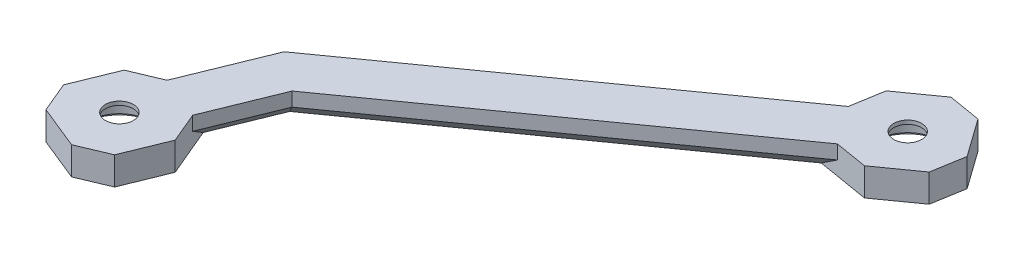
ISO-10303-21;
HEADER;
FILE_DESCRIPTION(('STEP AP214'),'2;1');
FILE_NAME('part.step','',(''),(''),'','','');
FILE_SCHEMA(('AUTOMOTIVE_DESIGN { 1 0 10303 214 1 1 1 1 }'));
ENDSEC;
DATA;
#1=APPLICATION_CONTEXT('core data for automotive mechanical design processes');
#2=APPLICATION_PROTOCOL_DEFINITION('international standard','automotive_design',2000,#1);
#3=PRODUCT_CONTEXT('',#1,'mechanical');
#4=PRODUCT('Part','Part','',(#3));
#5=PRODUCT_RELATED_PRODUCT_CATEGORY('part','',(#4));
#6=PRODUCT_DEFINITION_FORMATION('','',#4);
#7=PRODUCT_DEFINITION_CONTEXT('part definition',#1,'design');
#8=PRODUCT_DEFINITION('design','',#6,#7);
#9=PRODUCT_DEFINITION_SHAPE('','',#8);
#10=(LENGTH_UNIT() NAMED_UNIT(*) SI_UNIT(.MILLI.,.METRE.));
#11=(NAMED_UNIT(*) PLANE_ANGLE_UNIT() SI_UNIT($,.RADIAN.));
#12=(NAMED_UNIT(*) SI_UNIT($,.STERADIAN.) SOLID_ANGLE_UNIT());
#13=UNCERTAINTY_MEASURE_WITH_UNIT(LENGTH_MEASURE(1.E-05),#10,'distance_accuracy_value','');
#14=(GEOMETRIC_REPRESENTATION_CONTEXT(3) GLOBAL_UNCERTAINTY_ASSIGNED_CONTEXT((#13)) GLOBAL_UNIT_ASSIGNED_CONTEXT((#10,
#11,#12)) REPRESENTATION_CONTEXT('',''));
#15=CARTESIAN_POINT('',(0.,0.,0.));
#16=DIRECTION('',(0.,0.,1.));
#17=DIRECTION('',(1.,0.,0.));
#18=AXIS2_PLACEMENT_3D('',#15,#16,#17);
#19=CARTESIAN_POINT('',(70.000038384,-81.000004703,74.5));
#20=DIRECTION('',(0.,1.,0.));
#21=DIRECTION('',(-1.,0.,0.));
#22=AXIS2_PLACEMENT_3D('',#19,#20,#21);
#23=CYLINDRICAL_SURFACE('',#22,3.);
#24=DIRECTION('',(0.,-1.,0.));
#25=VECTOR('',#24,1.);
#26=CARTESIAN_POINT('',(67.000038384,-75.000004703,74.5));
#27=LINE('',#26,#25);
#28=CARTESIAN_POINT('',(67.000038384,-75.000004703,74.5));
#29=VERTEX_POINT('',#28);
#30=CARTESIAN_POINT('',(67.000038384,-75.800004703,74.5));
#31=VERTEX_POINT('',#30);
#32=EDGE_CURVE('E11',#29,#31,#27,.T.);
#33=ORIENTED_EDGE('',*,*,#32,.F.);
#34=CARTESIAN_POINT('',(70.000038384,-75.000004703,74.5));
#35=DIRECTION('',(0.,-1.,0.));
#36=DIRECTION('',(0.,0.,-1.));
#37=AXIS2_PLACEMENT_3D('',#34,#35,#36);
#38=CIRCLE('',#37,3.);
#39=CARTESIAN_POINT('',(70.000038384,-75.000004703,71.5));
#40=VERTEX_POINT('',#39);
#41=EDGE_CURVE('E56',#40,#29,#38,.T.);
#42=ORIENTED_EDGE('',*,*,#41,.F.);
#43=CARTESIAN_POINT('',(70.000038384,-75.000004703,74.5));
#44=DIRECTION('',(0.,-1.,0.));
#45=DIRECTION('',(0.,0.,-1.));
#46=AXIS2_PLACEMENT_3D('',#43,#44,#45);
#47=CIRCLE('',#46,3.);
#48=EDGE_CURVE('E337',#29,#40,#47,.T.);
#49=ORIENTED_EDGE('',*,*,#48,.F.);
#50=ORIENTED_EDGE('',*,*,#32,.T.);
#51=CARTESIAN_POINT('',(70.000038384,-75.800004703,74.5));
#52=DIRECTION('',(0.,-1.,0.));
#53=DIRECTION('',(0.,0.,-1.));
#54=AXIS2_PLACEMENT_3D('',#51,#52,#53);
#55=CIRCLE('',#54,3.);
#56=CARTESIAN_POINT('',(70.000038384,-75.800004703,71.5));
#57=VERTEX_POINT('',#56);
#58=EDGE_CURVE('E48',#31,#57,#55,.T.);
#59=ORIENTED_EDGE('',*,*,#58,.T.);
#60=CARTESIAN_POINT('',(70.000038384,-75.800004703,74.5));
#61=DIRECTION('',(0.,-1.,0.));
#62=DIRECTION('',(0.,0.,-1.));
#63=AXIS2_PLACEMENT_3D('',#60,#61,#62);
#64=CIRCLE('',#63,3.);
#65=EDGE_CURVE('E317',#57,#31,#64,.T.);
#66=ORIENTED_EDGE('',*,*,#65,.T.);
#67=EDGE_LOOP('',(#33,#42,#49,#50,#59,#66));
#68=FACE_BOUND('',#67,.T.);
#69=ADVANCED_FACE('F38',(#68),#23,.F.);
#70=CARTESIAN_POINT('',(-18.31462031,-81.000004703,155.743590884));
#71=DIRECTION('',(0.,1.,0.));
#72=DIRECTION('',(-1.,0.,0.));
#73=AXIS2_PLACEMENT_3D('',#70,#71,#72);
#74=CYLINDRICAL_SURFACE('',#73,3.);
#75=DIRECTION('',(0.,-1.,0.));
#76=VECTOR('',#75,1.);
#77=CARTESIAN_POINT('',(-21.31462031,-75.000004703,155.743590884));
#78=LINE('',#77,#76);
#79=CARTESIAN_POINT('',(-21.31462031,-75.000004703,155.743590884));
#80=VERTEX_POINT('',#79);
#81=CARTESIAN_POINT('',(-21.31462031,-75.800004703,155.743590884));
#82=VERTEX_POINT('',#81);
#83=EDGE_CURVE('E431',#80,#82,#78,.T.);
#84=ORIENTED_EDGE('',*,*,#83,.F.);
#85=CARTESIAN_POINT('',(-18.31462031,-75.000004703,155.743590884));
#86=DIRECTION('',(0.,-1.,0.));
#87=DIRECTION('',(0.,0.,-1.));
#88=AXIS2_PLACEMENT_3D('',#85,#86,#87);
#89=CIRCLE('',#88,3.);
#90=CARTESIAN_POINT('',(-18.31462031,-75.000004703,152.743590884));
#91=VERTEX_POINT('',#90);
#92=EDGE_CURVE('E335',#91,#80,#89,.T.);
#93=ORIENTED_EDGE('',*,*,#92,.F.);
#94=CARTESIAN_POINT('',(-18.31462031,-75.000004703,155.743590884));
#95=DIRECTION('',(0.,-1.,0.));
#96=DIRECTION('',(0.,0.,-1.));
#97=AXIS2_PLACEMENT_3D('',#94,#95,#96);
#98=CIRCLE('',#97,3.);
#99=EDGE_CURVE('E338',#80,#91,#98,.T.);
#100=ORIENTED_EDGE('',*,*,#99,.F.);
#101=ORIENTED_EDGE('',*,*,#83,.T.);
#102=CARTESIAN_POINT('',(-18.31462031,-75.800004703,155.743590884));
#103=DIRECTION('',(0.,-1.,0.));
#104=DIRECTION('',(0.,0.,-1.));
#105=AXIS2_PLACEMENT_3D('',#102,#103,#104);
#106=CIRCLE('',#105,3.);
#107=CARTESIAN_POINT('',(-18.31462031,-75.800004703,152.743590884));
#108=VERTEX_POINT('',#107);
#109=EDGE_CURVE('E412',#82,#108,#106,.T.);
#110=ORIENTED_EDGE('',*,*,#109,.T.);
#111=CARTESIAN_POINT('',(-18.31462031,-75.800004703,155.743590884));
#112=DIRECTION('',(0.,-1.,0.));
#113=DIRECTION('',(0.,0.,-1.));
#114=AXIS2_PLACEMENT_3D('',#111,#112,#113);
#115=CIRCLE('',#114,3.);
#116=EDGE_CURVE('E409',#108,#82,#115,.T.);
#117=ORIENTED_EDGE('',*,*,#116,.T.);
#118=EDGE_LOOP('',(#84,#93,#100,#101,#110,#117));
#119=FACE_BOUND('',#118,.T.);
#120=ADVANCED_FACE('F546',(#119),#74,.F.);
#121=CARTESIAN_POINT('',(76.693711629,-81.000004703,66.661330566));
#122=DIRECTION('',(0.814432056937501,0.,-0.580258928955472));
#123=DIRECTION('',(0.,-1.,0.));
#124=AXIS2_PLACEMENT_3D('',#121,#122,#123);
#125=PLANE('',#124);
#126=DIRECTION('',(-0.580258928955472,0.,-0.814432056937501));
#127=VECTOR('',#126,1.);
#128=CARTESIAN_POINT('',(81.045653598,-75.000004703,72.769570992));
#129=LINE('',#128,#127);
#130=CARTESIAN_POINT('',(81.045653598,-75.000004703,72.769570992));
#131=VERTEX_POINT('',#130);
#132=CARTESIAN_POINT('',(75.243064306,-75.000004703,64.625250424));
#133=VERTEX_POINT('',#132);
#134=EDGE_CURVE('E377',#131,#133,#129,.T.);
#135=ORIENTED_EDGE('',*,*,#134,.F.);
#136=DIRECTION('',(0.,1.,0.));
#137=VECTOR('',#136,1.);
#138=CARTESIAN_POINT('',(81.045653598,-81.000004703,72.769570992));
#139=LINE('',#138,#137);
#140=CARTESIAN_POINT('',(81.045653598,-81.000004703,72.769570992));
#141=VERTEX_POINT('',#140);
#142=EDGE_CURVE('E353',#141,#131,#139,.T.);
#143=ORIENTED_EDGE('',*,*,#142,.F.);
#144=DIRECTION('',(-0.580258928955472,0.,-0.814432056937501));
#145=VECTOR('',#144,1.);
#146=CARTESIAN_POINT('',(81.045653598,-81.000004703,72.769570992));
#147=LINE('',#146,#145);
#148=CARTESIAN_POINT('',(75.243064306,-81.000004703,64.625250424));
#149=VERTEX_POINT('',#148);
#150=EDGE_CURVE('E374',#141,#149,#147,.T.);
#151=ORIENTED_EDGE('',*,*,#150,.T.);
#152=DIRECTION('',(0.,1.,0.));
#153=VECTOR('',#152,1.);
#154=CARTESIAN_POINT('',(75.243064306,-81.000004703,64.625250424));
#155=LINE('',#154,#153);
#156=EDGE_CURVE('E371',#149,#133,#155,.T.);
#157=ORIENTED_EDGE('',*,*,#156,.T.);
#158=EDGE_LOOP('',(#135,#143,#151,#157));
#159=FACE_BOUND('',#158,.T.);
#160=ADVANCED_FACE('F473',(#159),#125,.T.);
#161=CARTESIAN_POINT('',(80.460220779,-81.000004703,76.256298457));
#162=DIRECTION('',(-0.986195453915951,0.,-0.165585405985888));
#163=DIRECTION('',(-0.165585405985888,0.,0.986195453915951));
#164=AXIS2_PLACEMENT_3D('',#161,#162,#163);
#165=PLANE('',#164);
#166=DIRECTION('',(-0.165585405985888,0.,0.986195453915951));
#167=VECTOR('',#166,1.);
#168=CARTESIAN_POINT('',(81.045653598,-75.000004703,72.769570992));
#169=LINE('',#168,#167);
#170=CARTESIAN_POINT('',(79.87478796,-75.000004703,79.743025922));
#171=VERTEX_POINT('',#170);
#172=EDGE_CURVE('E363',#131,#171,#169,.T.);
#173=ORIENTED_EDGE('',*,*,#172,.T.);
#174=DIRECTION('',(0.,1.,0.));
#175=VECTOR('',#174,1.);
#176=CARTESIAN_POINT('',(79.87478796,-81.000004703,79.743025922));
#177=LINE('',#176,#175);
#178=CARTESIAN_POINT('',(79.87478796,-81.000004703,79.743025922));
#179=VERTEX_POINT('',#178);
#180=EDGE_CURVE('E347',#179,#171,#177,.T.);
#181=ORIENTED_EDGE('',*,*,#180,.F.);
#182=DIRECTION('',(-0.165585405985888,0.,0.986195453915951));
#183=VECTOR('',#182,1.);
#184=CARTESIAN_POINT('',(81.045653598,-81.000004703,72.769570992));
#185=LINE('',#184,#183);
#186=EDGE_CURVE('E445',#141,#179,#185,.T.);
#187=ORIENTED_EDGE('',*,*,#186,.F.);
#188=ORIENTED_EDGE('',*,*,#142,.T.);
#189=EDGE_LOOP('',(#173,#181,#187,#188));
#190=FACE_BOUND('',#189,.T.);
#191=ADVANCED_FACE('F557',(#190),#165,.F.);
#192=CARTESIAN_POINT('',(38.075780483,-81.000004703,109.523591554));
#193=DIRECTION('',(-0.580258928955472,0.,-0.814432056937501));
#194=DIRECTION('',(-0.814432056937501,0.,0.580258928955472));
#195=AXIS2_PLACEMENT_3D('',#192,#193,#194);
#196=PLANE('',#195);
#197=DIRECTION('',(-0.814432056937501,0.,0.580258928955472));
#198=VECTOR('',#197,1.);
#199=CARTESIAN_POINT('',(79.87478796,-75.000004703,79.743025922));
#200=LINE('',#199,#198);
#201=CARTESIAN_POINT('',(71.730467392,-75.000004703,85.545615214));
#202=VERTEX_POINT('',#201);
#203=EDGE_CURVE('E349',#171,#202,#200,.T.);
#204=ORIENTED_EDGE('',*,*,#203,.T.);
#205=DIRECTION('',(0.,1.,0.));
#206=VECTOR('',#205,1.);
#207=CARTESIAN_POINT('',(71.730467392,-81.000004703,85.545615214));
#208=LINE('',#207,#206);
#209=CARTESIAN_POINT('',(71.730467392,-81.000004703,85.545615214));
#210=VERTEX_POINT('',#209);
#211=EDGE_CURVE('E291',#210,#202,#208,.T.);
#212=ORIENTED_EDGE('',*,*,#211,.F.);
#213=DIRECTION('',(-0.814432056937501,0.,0.580258928955472));
#214=VECTOR('',#213,1.);
#215=CARTESIAN_POINT('',(79.87478796,-81.000004703,79.743025922));
#216=LINE('',#215,#214);
#217=EDGE_CURVE('E283',#179,#210,#216,.T.);
#218=ORIENTED_EDGE('',*,*,#217,.F.);
#219=ORIENTED_EDGE('',*,*,#180,.T.);
#220=EDGE_LOOP('',(#204,#212,#218,#219));
#221=FACE_BOUND('',#220,.T.);
#222=ADVANCED_FACE('F560',(#221),#196,.F.);
#223=CARTESIAN_POINT('',(68.243739928,-81.000004703,84.960182395));
#224=DIRECTION('',(-0.165585405985888,0.,0.986195453915951));
#225=DIRECTION('',(0.,1.,0.));
#226=AXIS2_PLACEMENT_3D('',#223,#224,#225);
#227=PLANE('',#226);
#228=DIRECTION('',(0.986195453915951,0.,0.165585405985888));
#229=VECTOR('',#228,1.);
#230=CARTESIAN_POINT('',(64.757012463,-75.000004703,84.374749576));
#231=LINE('',#230,#229);
#232=CARTESIAN_POINT('',(64.757012463,-75.000004703,84.374749576));
#233=VERTEX_POINT('',#232);
#234=EDGE_CURVE('E388',#233,#202,#231,.T.);
#235=ORIENTED_EDGE('',*,*,#234,.F.);
#236=DIRECTION('',(0.,1.,0.));
#237=VECTOR('',#236,1.);
#238=CARTESIAN_POINT('',(64.757012463,-78.000004703,84.374749576));
#239=LINE('',#238,#237);
#240=CARTESIAN_POINT('',(64.757012463,-78.000004703,84.374749576));
#241=VERTEX_POINT('',#240);
#242=EDGE_CURVE('E292',#241,#233,#239,.T.);
#243=ORIENTED_EDGE('',*,*,#242,.F.);
#244=DIRECTION('',(-0.805225216231975,-0.577350269166327,-0.135199918038949));
#245=VECTOR('',#244,1.);
#246=CARTESIAN_POINT('',(64.757012463,-78.000004703,84.374749576));
#247=LINE('',#246,#245);
#248=CARTESIAN_POINT('',(60.572939505,-81.000004703,83.672230193));
#249=VERTEX_POINT('',#248);
#250=EDGE_CURVE('E350',#241,#249,#247,.T.);
#251=ORIENTED_EDGE('',*,*,#250,.T.);
#252=DIRECTION('',(0.986195453915951,0.,0.165585405985888));
#253=VECTOR('',#252,1.);
#254=CARTESIAN_POINT('',(60.572939505,-81.000004703,83.672230193));
#255=LINE('',#254,#253);
#256=EDGE_CURVE('E403',#249,#210,#255,.T.);
#257=ORIENTED_EDGE('',*,*,#256,.T.);
#258=ORIENTED_EDGE('',*,*,#211,.T.);
#259=EDGE_LOOP('',(#235,#243,#251,#257,#258));
#260=FACE_BOUND('',#259,.T.);
#261=ADVANCED_FACE('F590',(#260),#227,.T.);
#262=CARTESIAN_POINT('',(-3.73523297,-81.000004703,133.173463552));
#263=DIRECTION('',(-0.580258928955472,0.,-0.814432056937501));
#264=DIRECTION('',(-0.814432056937501,0.,0.580258928955472));
#265=AXIS2_PLACEMENT_3D('',#262,#263,#264);
#266=PLANE('',#265);
#267=DIRECTION('',(0.,1.,0.));
#268=VECTOR('',#267,1.);
#269=CARTESIAN_POINT('',(-3.73523297,-78.000004703,133.173463552));
#270=LINE('',#269,#268);
#271=CARTESIAN_POINT('',(-3.73523297,-78.000004703,133.173463552));
#272=VERTEX_POINT('',#271);
#273=CARTESIAN_POINT('',(-3.73523297,-75.000004703,133.173463552));
#274=VERTEX_POINT('',#273);
#275=EDGE_CURVE('E210',#272,#274,#270,.T.);
#276=ORIENTED_EDGE('',*,*,#275,.F.);
#277=DIRECTION('',(0.814432056937501,0.,-0.580258928955472));
#278=VECTOR('',#277,1.);
#279=CARTESIAN_POINT('',(-3.73523297,-78.000004703,133.173463552));
#280=LINE('',#279,#278);
#281=EDGE_CURVE('E289',#272,#241,#280,.T.);
#282=ORIENTED_EDGE('',*,*,#281,.T.);
#283=ORIENTED_EDGE('',*,*,#242,.T.);
#284=DIRECTION('',(-0.814432056937501,0.,0.580258928955472));
#285=VECTOR('',#284,1.);
#286=CARTESIAN_POINT('',(64.757012463,-75.000004703,84.374749576));
#287=LINE('',#286,#285);
#288=EDGE_CURVE('E344',#233,#274,#287,.T.);
#289=ORIENTED_EDGE('',*,*,#288,.T.);
#290=EDGE_LOOP('',(#276,#282,#283,#289));
#291=FACE_BOUND('',#290,.T.);
#292=ADVANCED_FACE('F587',(#291),#266,.F.);
#293=CARTESIAN_POINT('',(-6.825136324,-81.000004703,140.769115164));
#294=DIRECTION('',(0.926289153977071,0.,0.376813485990672));
#295=DIRECTION('',(0.,-1.,0.));
#296=AXIS2_PLACEMENT_3D('',#293,#294,#295);
#297=PLANE('',#296);
#298=DIRECTION('',(0.,1.,0.));
#299=VECTOR('',#298,1.);
#300=CARTESIAN_POINT('',(-9.915039679,-78.000004703,148.364766776));
#301=LINE('',#300,#299);
#302=CARTESIAN_POINT('',(-9.915039679,-78.000004703,148.364766776));
#303=VERTEX_POINT('',#302);
#304=CARTESIAN_POINT('',(-9.915039679,-75.000004703,148.364766776));
#305=VERTEX_POINT('',#304);
#306=EDGE_CURVE('E308',#303,#305,#301,.T.);
#307=ORIENTED_EDGE('',*,*,#306,.F.);
#308=DIRECTION('',(0.376813485990672,0.,-0.926289153977071));
#309=VECTOR('',#308,1.);
#310=CARTESIAN_POINT('',(-9.915039679,-78.000004703,148.364766776));
#311=LINE('',#310,#309);
#312=EDGE_CURVE('E346',#303,#272,#311,.T.);
#313=ORIENTED_EDGE('',*,*,#312,.T.);
#314=ORIENTED_EDGE('',*,*,#275,.T.);
#315=DIRECTION('',(0.376813485990672,0.,-0.926289153977071));
#316=VECTOR('',#315,1.);
#317=CARTESIAN_POINT('',(-9.915039679,-75.000004703,148.364766776));
#318=LINE('',#317,#316);
#319=EDGE_CURVE('E391',#305,#274,#318,.T.);
#320=ORIENTED_EDGE('',*,*,#319,.F.);
#321=EDGE_LOOP('',(#307,#313,#314,#320));
#322=FACE_BOUND('',#321,.T.);
#323=ADVANCED_FACE('F492',(#322),#297,.T.);
#324=CARTESIAN_POINT('',(-8.541350509,-81.000004703,151.622523376));
#325=DIRECTION('',(-0.921432713232506,0.,0.388537971098041));
#326=DIRECTION('',(0.,1.,0.));
#327=AXIS2_PLACEMENT_3D('',#324,#325,#326);
#328=PLANE('',#327);
#329=DIRECTION('',(0.388537971098041,0.,0.921432713232506));
#330=VECTOR('',#329,1.);
#331=CARTESIAN_POINT('',(-9.915039679,-75.000004703,148.364766776));
#332=LINE('',#331,#330);
#333=CARTESIAN_POINT('',(-7.16766134,-75.000004703,154.880279976));
#334=VERTEX_POINT('',#333);
#335=EDGE_CURVE('E438',#305,#334,#332,.T.);
#336=ORIENTED_EDGE('',*,*,#335,.T.);
#337=DIRECTION('',(0.,1.,0.));
#338=VECTOR('',#337,1.);
#339=CARTESIAN_POINT('',(-7.16766134,-81.000004703,154.880279976));
#340=LINE('',#339,#338);
#341=CARTESIAN_POINT('',(-7.16766134,-81.000004703,154.880279976));
#342=VERTEX_POINT('',#341);
#343=EDGE_CURVE('E309',#342,#334,#340,.T.);
#344=ORIENTED_EDGE('',*,*,#343,.F.);
#345=DIRECTION('',(0.388537971098041,0.,0.921432713232506));
#346=VECTOR('',#345,1.);
#347=CARTESIAN_POINT('',(-11.563466682,-81.000004703,144.455458855));
#348=LINE('',#347,#346);
#349=CARTESIAN_POINT('',(-11.563466682,-81.000004703,144.455458855));
#350=VERTEX_POINT('',#349);
#351=EDGE_CURVE('E364',#350,#342,#348,.T.);
#352=ORIENTED_EDGE('',*,*,#351,.F.);
#353=DIRECTION('',(0.317239925009274,0.577350269016878,0.752346660021994));
#354=VECTOR('',#353,1.);
#355=CARTESIAN_POINT('',(-11.563466682,-81.000004703,144.455458855));
#356=LINE('',#355,#354);
#357=EDGE_CURVE('E356',#350,#303,#356,.T.);
#358=ORIENTED_EDGE('',*,*,#357,.T.);
#359=ORIENTED_EDGE('',*,*,#306,.T.);
#360=EDGE_LOOP('',(#336,#344,#352,#358,#359));
#361=FACE_BOUND('',#360,.T.);
#362=ADVANCED_FACE('F495',(#361),#328,.F.);
#363=CARTESIAN_POINT('',(-0.024663025,-81.000004703,137.321243191));
#364=DIRECTION('',(0.926289153977071,0.,0.376813485990672));
#365=DIRECTION('',(0.,-1.,0.));
#366=AXIS2_PLACEMENT_3D('',#363,#364,#365);
#367=PLANE('',#366);
#368=DIRECTION('',(0.376813485990672,0.,-0.926289153977071));
#369=VECTOR('',#368,1.);
#370=CARTESIAN_POINT('',(-10.935796202,-75.000004703,164.143171515));
#371=LINE('',#370,#369);
#372=CARTESIAN_POINT('',(-10.935796202,-75.000004703,164.143171515));
#373=VERTEX_POINT('',#372);
#374=EDGE_CURVE('E359',#373,#334,#371,.T.);
#375=ORIENTED_EDGE('',*,*,#374,.F.);
#376=DIRECTION('',(0.,1.,0.));
#377=VECTOR('',#376,1.);
#378=CARTESIAN_POINT('',(-10.935796202,-81.000004703,164.143171515));
#379=LINE('',#378,#377);
#380=CARTESIAN_POINT('',(-10.935796202,-81.000004703,164.143171515));
#381=VERTEX_POINT('',#380);
#382=EDGE_CURVE('E297',#381,#373,#379,.T.);
#383=ORIENTED_EDGE('',*,*,#382,.F.);
#384=DIRECTION('',(0.376813485990672,0.,-0.926289153977071));
#385=VECTOR('',#384,1.);
#386=CARTESIAN_POINT('',(-10.935796202,-81.000004703,164.143171515));
#387=LINE('',#386,#385);
#388=EDGE_CURVE('E305',#381,#342,#387,.T.);
#389=ORIENTED_EDGE('',*,*,#388,.T.);
#390=ORIENTED_EDGE('',*,*,#343,.T.);
#391=EDGE_LOOP('',(#375,#383,#389,#390));
#392=FACE_BOUND('',#391,.T.);
#393=ADVANCED_FACE('F651',(#392),#367,.T.);
#394=CARTESIAN_POINT('',(-14.193552803,-81.000004703,165.516860684));
#395=DIRECTION('',(-0.388537971098041,0.,-0.921432713232506));
#396=DIRECTION('',(-0.921432713232506,0.,0.388537971098041));
#397=AXIS2_PLACEMENT_3D('',#394,#395,#396);
#398=PLANE('',#397);
#399=DIRECTION('',(-0.921432713232506,0.,0.388537971098041));
#400=VECTOR('',#399,1.);
#401=CARTESIAN_POINT('',(-10.935796202,-75.000004703,164.143171515));
#402=LINE('',#401,#400);
#403=CARTESIAN_POINT('',(-17.451309403,-75.000004703,166.890549854));
#404=VERTEX_POINT('',#403);
#405=EDGE_CURVE('E300',#373,#404,#402,.T.);
#406=ORIENTED_EDGE('',*,*,#405,.T.);
#407=DIRECTION('',(0.,1.,0.));
#408=VECTOR('',#407,1.);
#409=CARTESIAN_POINT('',(-17.451309403,-81.000004703,166.890549854));
#410=LINE('',#409,#408);
#411=CARTESIAN_POINT('',(-17.451309403,-81.000004703,166.890549854));
#412=VERTEX_POINT('',#411);
#413=EDGE_CURVE('E394',#412,#404,#410,.T.);
#414=ORIENTED_EDGE('',*,*,#413,.F.);
#415=DIRECTION('',(-0.921432713232506,0.,0.388537971098041));
#416=VECTOR('',#415,1.);
#417=CARTESIAN_POINT('',(-10.935796202,-81.000004703,164.143171515));
#418=LINE('',#417,#416);
#419=EDGE_CURVE('E325',#381,#412,#418,.T.);
#420=ORIENTED_EDGE('',*,*,#419,.F.);
#421=ORIENTED_EDGE('',*,*,#382,.T.);
#422=EDGE_LOOP('',(#406,#414,#420,#421));
#423=FACE_BOUND('',#422,.T.);
#424=ADVANCED_FACE('F606',(#423),#398,.F.);
#425=CARTESIAN_POINT('',(-19.767032287,-81.000004703,165.948516138));
#426=DIRECTION('',(-0.376813485990672,0.,0.926289153977071));
#427=DIRECTION('',(0.,1.,0.));
#428=AXIS2_PLACEMENT_3D('',#425,#426,#427);
#429=PLANE('',#428);
#430=DIRECTION('',(0.926289153977071,0.,0.376813485990672));
#431=VECTOR('',#430,1.);
#432=CARTESIAN_POINT('',(-26.714200942,-75.000004703,163.122414991));
#433=LINE('',#432,#431);
#434=CARTESIAN_POINT('',(-26.714200942,-75.000004703,163.122414991));
#435=VERTEX_POINT('',#434);
#436=EDGE_CURVE('E357',#435,#404,#433,.T.);
#437=ORIENTED_EDGE('',*,*,#436,.F.);
#438=DIRECTION('',(0.,1.,0.));
#439=VECTOR('',#438,1.);
#440=CARTESIAN_POINT('',(-26.714200942,-81.000004703,163.122414991));
#441=LINE('',#440,#439);
#442=CARTESIAN_POINT('',(-26.714200942,-81.000004703,163.122414991));
#443=VERTEX_POINT('',#442);
#444=EDGE_CURVE('E422',#443,#435,#441,.T.);
#445=ORIENTED_EDGE('',*,*,#444,.F.);
#446=DIRECTION('',(0.926289153977071,0.,0.376813485990672));
#447=VECTOR('',#446,1.);
#448=CARTESIAN_POINT('',(-26.714200942,-81.000004703,163.122414991));
#449=LINE('',#448,#447);
#450=EDGE_CURVE('E301',#443,#412,#449,.T.);
#451=ORIENTED_EDGE('',*,*,#450,.T.);
#452=ORIENTED_EDGE('',*,*,#413,.T.);
#453=EDGE_LOOP('',(#437,#445,#451,#452));
#454=FACE_BOUND('',#453,.T.);
#455=ADVANCED_FACE('F585',(#454),#429,.T.);
#456=CARTESIAN_POINT('',(-28.087890111,-81.000004703,159.864658391));
#457=DIRECTION('',(-0.921432713232506,0.,0.388537971098041));
#458=DIRECTION('',(0.,1.,0.));
#459=AXIS2_PLACEMENT_3D('',#456,#457,#458);
#460=PLANE('',#459);
#461=DIRECTION('',(0.388537971098041,0.,0.921432713232506));
#462=VECTOR('',#461,1.);
#463=CARTESIAN_POINT('',(-29.46157928,-75.000004703,156.606901791));
#464=LINE('',#463,#462);
#465=CARTESIAN_POINT('',(-29.46157928,-75.000004703,156.606901791));
#466=VERTEX_POINT('',#465);
#467=EDGE_CURVE('E343',#466,#435,#464,.T.);
#468=ORIENTED_EDGE('',*,*,#467,.F.);
#469=DIRECTION('',(0.,1.,0.));
#470=VECTOR('',#469,1.);
#471=CARTESIAN_POINT('',(-29.46157928,-81.000004703,156.606901791));
#472=LINE('',#471,#470);
#473=CARTESIAN_POINT('',(-29.46157928,-81.000004703,156.606901791));
#474=VERTEX_POINT('',#473);
#475=EDGE_CURVE('E398',#474,#466,#472,.T.);
#476=ORIENTED_EDGE('',*,*,#475,.F.);
#477=DIRECTION('',(0.388537971098041,0.,0.921432713232506));
#478=VECTOR('',#477,1.);
#479=CARTESIAN_POINT('',(-29.46157928,-81.000004703,156.606901791));
#480=LINE('',#479,#478);
#481=EDGE_CURVE('E418',#474,#443,#480,.T.);
#482=ORIENTED_EDGE('',*,*,#481,.T.);
#483=ORIENTED_EDGE('',*,*,#444,.T.);
#484=EDGE_LOOP('',(#468,#476,#482,#483));
#485=FACE_BOUND('',#484,.T.);
#486=ADVANCED_FACE('F582',(#485),#460,.T.);
#487=CARTESIAN_POINT('',(-18.550446103,-81.000004703,129.784973467));
#488=DIRECTION('',(0.926289153977071,0.,0.376813485990672));
#489=DIRECTION('',(0.,-1.,0.));
#490=AXIS2_PLACEMENT_3D('',#487,#488,#489);
#491=PLANE('',#490);
#492=DIRECTION('',(0.376813485990672,0.,-0.926289153977071));
#493=VECTOR('',#492,1.);
#494=CARTESIAN_POINT('',(-29.46157928,-75.000004703,156.606901791));
#495=LINE('',#494,#493);
#496=CARTESIAN_POINT('',(-25.693444418,-75.000004703,147.344010252));
#497=VERTEX_POINT('',#496);
#498=EDGE_CURVE('E406',#466,#497,#495,.T.);
#499=ORIENTED_EDGE('',*,*,#498,.T.);
#500=DIRECTION('',(0.,1.,0.));
#501=VECTOR('',#500,1.);
#502=CARTESIAN_POINT('',(-25.693444418,-81.000004703,147.344010252));
#503=LINE('',#502,#501);
#504=CARTESIAN_POINT('',(-25.693444418,-81.000004703,147.344010252));
#505=VERTEX_POINT('',#504);
#506=EDGE_CURVE('E459',#505,#497,#503,.T.);
#507=ORIENTED_EDGE('',*,*,#506,.F.);
#508=DIRECTION('',(0.376813485990672,0.,-0.926289153977071));
#509=VECTOR('',#508,1.);
#510=CARTESIAN_POINT('',(-29.46157928,-81.000004703,156.606901791));
#511=LINE('',#510,#509);
#512=EDGE_CURVE('E323',#474,#505,#511,.T.);
#513=ORIENTED_EDGE('',*,*,#512,.F.);
#514=ORIENTED_EDGE('',*,*,#475,.T.);
#515=EDGE_LOOP('',(#499,#507,#513,#514));
#516=FACE_BOUND('',#515,.T.);
#517=ADVANCED_FACE('F578',(#516),#491,.F.);
#518=CARTESIAN_POINT('',(-22.435687818,-81.000004703,145.970321083));
#519=DIRECTION('',(0.388537971098041,0.,0.921432713232506));
#520=DIRECTION('',(0.,-1.,0.));
#521=AXIS2_PLACEMENT_3D('',#518,#519,#520);
#522=PLANE('',#521);
#523=DIRECTION('',(0.921432713232506,0.,-0.388537971098041));
#524=VECTOR('',#523,1.);
#525=CARTESIAN_POINT('',(-25.693444418,-75.000004703,147.344010252));
#526=LINE('',#525,#524);
#527=CARTESIAN_POINT('',(-19.177931217,-75.000004703,144.596631914));
#528=VERTEX_POINT('',#527);
#529=EDGE_CURVE('E395',#497,#528,#526,.T.);
#530=ORIENTED_EDGE('',*,*,#529,.T.);
#531=DIRECTION('',(0.,1.,0.));
#532=VECTOR('',#531,1.);
#533=CARTESIAN_POINT('',(-19.177931217,-78.000004703,144.596631914));
#534=LINE('',#533,#532);
#535=CARTESIAN_POINT('',(-19.177931217,-78.000004703,144.596631914));
#536=VERTEX_POINT('',#535);
#537=EDGE_CURVE('E330',#536,#528,#534,.T.);
#538=ORIENTED_EDGE('',*,*,#537,.F.);
#539=DIRECTION('',(0.752346660021994,-0.577350269016878,-0.317239925009274));
#540=VECTOR('',#539,1.);
#541=CARTESIAN_POINT('',(-19.177931217,-78.000004703,144.596631914));
#542=LINE('',#541,#540);
#543=CARTESIAN_POINT('',(-15.268623297,-81.000004703,142.948204911));
#544=VERTEX_POINT('',#543);
#545=EDGE_CURVE('E42',#536,#544,#542,.T.);
#546=ORIENTED_EDGE('',*,*,#545,.T.);
#547=DIRECTION('',(0.921432713232506,0.,-0.388537971098041));
#548=VECTOR('',#547,1.);
#549=CARTESIAN_POINT('',(-25.693444418,-81.000004703,147.344010252));
#550=LINE('',#549,#548);
#551=EDGE_CURVE('E326',#505,#544,#550,.T.);
#552=ORIENTED_EDGE('',*,*,#551,.F.);
#553=ORIENTED_EDGE('',*,*,#506,.T.);
#554=EDGE_LOOP('',(#530,#538,#546,#552,#553));
#555=FACE_BOUND('',#554,.T.);
#556=ADVANCED_FACE('F575',(#555),#522,.F.);
#557=CARTESIAN_POINT('',(-15.540748353,-81.000004703,135.655648746));
#558=DIRECTION('',(0.926289153977071,0.,0.376813485990672));
#559=DIRECTION('',(0.,-1.,0.));
#560=AXIS2_PLACEMENT_3D('',#557,#558,#559);
#561=PLANE('',#560);
#562=DIRECTION('',(0.,1.,0.));
#563=VECTOR('',#562,1.);
#564=CARTESIAN_POINT('',(-11.903565489,-78.000004703,126.714665578));
#565=LINE('',#564,#563);
#566=CARTESIAN_POINT('',(-11.903565489,-78.000004703,126.714665578));
#567=VERTEX_POINT('',#566);
#568=CARTESIAN_POINT('',(-11.903565489,-75.000004703,126.714665578));
#569=VERTEX_POINT('',#568);
#570=EDGE_CURVE('E401',#567,#569,#565,.T.);
#571=ORIENTED_EDGE('',*,*,#570,.F.);
#572=DIRECTION('',(-0.376813485990672,0.,0.926289153977071));
#573=VECTOR('',#572,1.);
#574=CARTESIAN_POINT('',(-11.903565489,-78.000004703,126.714665578));
#575=LINE('',#574,#573);
#576=EDGE_CURVE('E462',#567,#536,#575,.T.);
#577=ORIENTED_EDGE('',*,*,#576,.T.);
#578=ORIENTED_EDGE('',*,*,#537,.T.);
#579=DIRECTION('',(0.376813485990672,0.,-0.926289153977071));
#580=VECTOR('',#579,1.);
#581=CARTESIAN_POINT('',(-19.177931217,-75.000004703,144.596631914));
#582=LINE('',#581,#580);
#583=EDGE_CURVE('E327',#528,#569,#582,.T.);
#584=ORIENTED_EDGE('',*,*,#583,.T.);
#585=EDGE_LOOP('',(#571,#577,#578,#584));
#586=FACE_BOUND('',#585,.T.);
#587=ADVANCED_FACE('F517',(#586),#561,.F.);
#588=CARTESIAN_POINT('',(17.053694876,-81.000004703,106.083467736));
#589=DIRECTION('',(-0.580258928955472,0.,-0.814432056937501));
#590=DIRECTION('',(-0.814432056937501,0.,0.580258928955472));
#591=AXIS2_PLACEMENT_3D('',#588,#589,#590);
#592=PLANE('',#591);
#593=DIRECTION('',(0.,1.,0.));
#594=VECTOR('',#593,1.);
#595=CARTESIAN_POINT('',(58.954423171,-78.000004703,76.230429008));
#596=LINE('',#595,#594);
#597=CARTESIAN_POINT('',(58.954423171,-78.000004703,76.230429008));
#598=VERTEX_POINT('',#597);
#599=CARTESIAN_POINT('',(58.954423171,-75.000004703,76.230429008));
#600=VERTEX_POINT('',#599);
#601=EDGE_CURVE('E272',#598,#600,#596,.T.);
#602=ORIENTED_EDGE('',*,*,#601,.F.);
#603=DIRECTION('',(-0.814432056937501,0.,0.580258928955472));
#604=VECTOR('',#603,1.);
#605=CARTESIAN_POINT('',(58.954423171,-78.000004703,76.230429008));
#606=LINE('',#605,#604);
#607=EDGE_CURVE('E331',#598,#567,#606,.T.);
#608=ORIENTED_EDGE('',*,*,#607,.T.);
#609=ORIENTED_EDGE('',*,*,#570,.T.);
#610=DIRECTION('',(-0.814432056937501,0.,0.580258928955472));
#611=VECTOR('',#610,1.);
#612=CARTESIAN_POINT('',(58.954423171,-75.000004703,76.230429008));
#613=LINE('',#612,#611);
#614=EDGE_CURVE('E339',#600,#569,#613,.T.);
#615=ORIENTED_EDGE('',*,*,#614,.F.);
#616=EDGE_LOOP('',(#602,#608,#609,#615));
#617=FACE_BOUND('',#616,.T.);
#618=ADVANCED_FACE('F529',(#617),#592,.T.);
#619=CARTESIAN_POINT('',(59.53985599,-81.000004703,72.743701543));
#620=DIRECTION('',(0.986195453915951,0.,0.165585405985888));
#621=DIRECTION('',(0.,-1.,0.));
#622=AXIS2_PLACEMENT_3D('',#619,#620,#621);
#623=PLANE('',#622);
#624=DIRECTION('',(0.165585405985888,0.,-0.986195453915951));
#625=VECTOR('',#624,1.);
#626=CARTESIAN_POINT('',(58.954423171,-75.000004703,76.230429008));
#627=LINE('',#626,#625);
#628=CARTESIAN_POINT('',(60.125288809,-75.000004703,69.256974078));
#629=VERTEX_POINT('',#628);
#630=EDGE_CURVE('E264',#600,#629,#627,.T.);
#631=ORIENTED_EDGE('',*,*,#630,.T.);
#632=DIRECTION('',(0.,1.,0.));
#633=VECTOR('',#632,1.);
#634=CARTESIAN_POINT('',(60.125288809,-81.000004703,69.256974078));
#635=LINE('',#634,#633);
#636=CARTESIAN_POINT('',(60.125288809,-81.000004703,69.256974078));
#637=VERTEX_POINT('',#636);
#638=EDGE_CURVE('E260',#637,#629,#635,.T.);
#639=ORIENTED_EDGE('',*,*,#638,.F.);
#640=DIRECTION('',(0.165585405985888,0.,-0.986195453915951));
#641=VECTOR('',#640,1.);
#642=CARTESIAN_POINT('',(58.251903788,-81.000004703,80.414501966));
#643=LINE('',#642,#641);
#644=CARTESIAN_POINT('',(58.251903788,-81.000004703,80.414501966));
#645=VERTEX_POINT('',#644);
#646=EDGE_CURVE('E245',#645,#637,#643,.T.);
#647=ORIENTED_EDGE('',*,*,#646,.F.);
#648=DIRECTION('',(0.135199918038949,0.577350269166327,-0.805225216231975));
#649=VECTOR('',#648,1.);
#650=CARTESIAN_POINT('',(58.251903788,-81.000004703,80.414501966));
#651=LINE('',#650,#649);
#652=EDGE_CURVE('E274',#645,#598,#651,.T.);
#653=ORIENTED_EDGE('',*,*,#652,.T.);
#654=ORIENTED_EDGE('',*,*,#601,.T.);
#655=EDGE_LOOP('',(#631,#639,#647,#653,#654));
#656=FACE_BOUND('',#655,.T.);
#657=ADVANCED_FACE('F261',(#656),#623,.F.);
#658=CARTESIAN_POINT('',(24.104858672,-81.000004703,94.920473011));
#659=DIRECTION('',(-0.580258928955472,0.,-0.814432056937501));
#660=DIRECTION('',(-0.814432056937501,0.,0.580258928955472));
#661=AXIS2_PLACEMENT_3D('',#658,#659,#660);
#662=PLANE('',#661);
#663=DIRECTION('',(-0.814432056937501,0.,0.580258928955472));
#664=VECTOR('',#663,1.);
#665=CARTESIAN_POINT('',(68.269609376,-75.000004703,63.454384786));
#666=LINE('',#665,#664);
#667=CARTESIAN_POINT('',(68.269609376,-75.000004703,63.454384786));
#668=VERTEX_POINT('',#667);
#669=EDGE_CURVE('E342',#668,#629,#666,.T.);
#670=ORIENTED_EDGE('',*,*,#669,.F.);
#671=DIRECTION('',(0.,1.,0.));
#672=VECTOR('',#671,1.);
#673=CARTESIAN_POINT('',(68.269609376,-81.000004703,63.454384786));
#674=LINE('',#673,#672);
#675=CARTESIAN_POINT('',(68.269609376,-81.000004703,63.454384786));
#676=VERTEX_POINT('',#675);
#677=EDGE_CURVE('E271',#676,#668,#674,.T.);
#678=ORIENTED_EDGE('',*,*,#677,.F.);
#679=DIRECTION('',(-0.814432056937501,0.,0.580258928955472));
#680=VECTOR('',#679,1.);
#681=CARTESIAN_POINT('',(68.269609376,-81.000004703,63.454384786));
#682=LINE('',#681,#680);
#683=EDGE_CURVE('E250',#676,#637,#682,.T.);
#684=ORIENTED_EDGE('',*,*,#683,.T.);
#685=ORIENTED_EDGE('',*,*,#638,.T.);
#686=EDGE_LOOP('',(#670,#678,#684,#685));
#687=FACE_BOUND('',#686,.T.);
#688=ADVANCED_FACE('F269',(#687),#662,.T.);
#689=CARTESIAN_POINT('',(71.756336841,-81.000004703,64.039817605));
#690=DIRECTION('',(-0.165585405985888,0.,0.986195453915951));
#691=DIRECTION('',(0.,1.,0.));
#692=AXIS2_PLACEMENT_3D('',#689,#690,#691);
#693=PLANE('',#692);
#694=DIRECTION('',(0.986195453915951,0.,0.165585405985888));
#695=VECTOR('',#694,1.);
#696=CARTESIAN_POINT('',(68.269609376,-75.000004703,63.454384786));
#697=LINE('',#696,#695);
#698=EDGE_CURVE('E267',#668,#133,#697,.T.);
#699=ORIENTED_EDGE('',*,*,#698,.T.);
#700=ORIENTED_EDGE('',*,*,#156,.F.);
#701=DIRECTION('',(0.986195453915951,0.,0.165585405985888));
#702=VECTOR('',#701,1.);
#703=CARTESIAN_POINT('',(68.269609376,-81.000004703,63.454384786));
#704=LINE('',#703,#702);
#705=EDGE_CURVE('E257',#676,#149,#704,.T.);
#706=ORIENTED_EDGE('',*,*,#705,.F.);
#707=ORIENTED_EDGE('',*,*,#677,.T.);
#708=EDGE_LOOP('',(#699,#700,#706,#707));
#709=FACE_BOUND('',#708,.T.);
#710=ADVANCED_FACE('F533',(#709),#693,.F.);
#711=CARTESIAN_POINT('',(61.68537969,-81.000004703,265.743590884));
#712=DIRECTION('',(0.,-1.,0.));
#713=DIRECTION('',(0.,0.,-1.));
#714=AXIS2_PLACEMENT_3D('',#711,#712,#713);
#715=PLANE('',#714);
#716=CARTESIAN_POINT('',(70.000038384,-81.000004703,74.5));
#717=DIRECTION('',(0.,-1.,0.));
#718=DIRECTION('',(0.,0.,-1.));
#719=AXIS2_PLACEMENT_3D('',#716,#717,#718);
#720=CIRCLE('',#719,7.85);
#721=CARTESIAN_POINT('',(62.150038384,-81.000004703,74.5));
#722=VERTEX_POINT('',#721);
#723=CARTESIAN_POINT('',(70.000038384,-81.000004703,66.65));
#724=VERTEX_POINT('',#723);
#725=EDGE_CURVE('E468',#722,#724,#720,.T.);
#726=ORIENTED_EDGE('',*,*,#725,.F.);
#727=CARTESIAN_POINT('',(70.000038384,-81.000004703,74.5));
#728=DIRECTION('',(0.,-1.,0.));
#729=DIRECTION('',(0.,0.,-1.));
#730=AXIS2_PLACEMENT_3D('',#727,#728,#729);
#731=CIRCLE('',#730,7.85);
#732=EDGE_CURVE('E334',#724,#722,#731,.T.);
#733=ORIENTED_EDGE('',*,*,#732,.F.);
#734=EDGE_LOOP('',(#726,#733));
#735=FACE_BOUND('',#734,.T.);
#736=CARTESIAN_POINT('',(-18.31462031,-81.000004703,155.743590884));
#737=DIRECTION('',(0.,-1.,0.));
#738=DIRECTION('',(0.,0.,-1.));
#739=AXIS2_PLACEMENT_3D('',#736,#737,#738);
#740=CIRCLE('',#739,7.85);
#741=CARTESIAN_POINT('',(-26.16462031,-81.000004703,155.743590884));
#742=VERTEX_POINT('',#741);
#743=CARTESIAN_POINT('',(-18.31462031,-81.000004703,147.893590884));
#744=VERTEX_POINT('',#743);
#745=EDGE_CURVE('E321',#742,#744,#740,.T.);
#746=ORIENTED_EDGE('',*,*,#745,.F.);
#747=CARTESIAN_POINT('',(-18.31462031,-81.000004703,155.743590884));
#748=DIRECTION('',(0.,-1.,0.));
#749=DIRECTION('',(0.,0.,-1.));
#750=AXIS2_PLACEMENT_3D('',#747,#748,#749);
#751=CIRCLE('',#750,7.85);
#752=EDGE_CURVE('E319',#744,#742,#751,.T.);
#753=ORIENTED_EDGE('',*,*,#752,.F.);
#754=EDGE_LOOP('',(#746,#753));
#755=FACE_BOUND('',#754,.T.);
#756=DIRECTION('',(0.814432056937501,0.,-0.580258928955472));
#757=VECTOR('',#756,1.);
#758=CARTESIAN_POINT('',(-9.453065734,-81.000004703,128.65230497));
#759=LINE('',#758,#757);
#760=CARTESIAN_POINT('',(-9.453065734,-81.000004703,128.65230497));
#761=VERTEX_POINT('',#760);
#762=EDGE_CURVE('E253',#761,#645,#759,.T.);
#763=ORIENTED_EDGE('',*,*,#762,.T.);
#764=ORIENTED_EDGE('',*,*,#646,.T.);
#765=ORIENTED_EDGE('',*,*,#683,.F.);
#766=ORIENTED_EDGE('',*,*,#705,.T.);
#767=ORIENTED_EDGE('',*,*,#150,.F.);
#768=ORIENTED_EDGE('',*,*,#186,.T.);
#769=ORIENTED_EDGE('',*,*,#217,.T.);
#770=ORIENTED_EDGE('',*,*,#256,.F.);
#771=DIRECTION('',(-0.814432056937501,0.,0.580258928955472));
#772=VECTOR('',#771,1.);
#773=CARTESIAN_POINT('',(60.572939505,-81.000004703,83.672230193));
#774=LINE('',#773,#772);
#775=CARTESIAN_POINT('',(-6.185732726,-81.000004703,131.23582416));
#776=VERTEX_POINT('',#775);
#777=EDGE_CURVE('E280',#249,#776,#774,.T.);
#778=ORIENTED_EDGE('',*,*,#777,.T.);
#779=DIRECTION('',(-0.376813485990672,0.,0.926289153977071));
#780=VECTOR('',#779,1.);
#781=CARTESIAN_POINT('',(-6.185732726,-81.000004703,131.23582416));
#782=LINE('',#781,#780);
#783=EDGE_CURVE('E278',#776,#350,#782,.T.);
#784=ORIENTED_EDGE('',*,*,#783,.T.);
#785=ORIENTED_EDGE('',*,*,#351,.T.);
#786=ORIENTED_EDGE('',*,*,#388,.F.);
#787=ORIENTED_EDGE('',*,*,#419,.T.);
#788=ORIENTED_EDGE('',*,*,#450,.F.);
#789=ORIENTED_EDGE('',*,*,#481,.F.);
#790=ORIENTED_EDGE('',*,*,#512,.T.);
#791=ORIENTED_EDGE('',*,*,#551,.T.);
#792=DIRECTION('',(0.376813485990672,0.,-0.926289153977071));
#793=VECTOR('',#792,1.);
#794=CARTESIAN_POINT('',(-15.268623297,-81.000004703,142.948204911));
#795=LINE('',#794,#793);
#796=EDGE_CURVE('E370',#544,#761,#795,.T.);
#797=ORIENTED_EDGE('',*,*,#796,.T.);
#798=EDGE_LOOP('',(#763,#764,#765,#766,#767,#768,#769,#770,#778,#784,#785,#786,#787,#788,#789,
#790,#791,#797));
#799=FACE_BOUND('',#798,.T.);
#800=ADVANCED_FACE('F247',(#735,#755,#799),#715,.T.);
#801=CARTESIAN_POINT('',(61.68537969,-75.000004703,265.743590884));
#802=DIRECTION('',(0.,-1.,0.));
#803=DIRECTION('',(0.,0.,-1.));
#804=AXIS2_PLACEMENT_3D('',#801,#802,#803);
#805=PLANE('',#804);
#806=ORIENTED_EDGE('',*,*,#134,.T.);
#807=ORIENTED_EDGE('',*,*,#698,.F.);
#808=ORIENTED_EDGE('',*,*,#669,.T.);
#809=ORIENTED_EDGE('',*,*,#630,.F.);
#810=ORIENTED_EDGE('',*,*,#614,.T.);
#811=ORIENTED_EDGE('',*,*,#583,.F.);
#812=ORIENTED_EDGE('',*,*,#529,.F.);
#813=ORIENTED_EDGE('',*,*,#498,.F.);
#814=ORIENTED_EDGE('',*,*,#467,.T.);
#815=ORIENTED_EDGE('',*,*,#436,.T.);
#816=ORIENTED_EDGE('',*,*,#405,.F.);
#817=ORIENTED_EDGE('',*,*,#374,.T.);
#818=ORIENTED_EDGE('',*,*,#335,.F.);
#819=ORIENTED_EDGE('',*,*,#319,.T.);
#820=ORIENTED_EDGE('',*,*,#288,.F.);
#821=ORIENTED_EDGE('',*,*,#234,.T.);
#822=ORIENTED_EDGE('',*,*,#203,.F.);
#823=ORIENTED_EDGE('',*,*,#172,.F.);
#824=EDGE_LOOP('',(#806,#807,#808,#809,#810,#811,#812,#813,#814,#815,#816,#817,#818,#819,#820,
#821,#822,#823));
#825=FACE_BOUND('',#824,.T.);
#826=ORIENTED_EDGE('',*,*,#41,.T.);
#827=ORIENTED_EDGE('',*,*,#48,.T.);
#828=EDGE_LOOP('',(#826,#827));
#829=FACE_BOUND('',#828,.T.);
#830=ORIENTED_EDGE('',*,*,#92,.T.);
#831=ORIENTED_EDGE('',*,*,#99,.T.);
#832=EDGE_LOOP('',(#830,#831));
#833=FACE_BOUND('',#832,.T.);
#834=ADVANCED_FACE('F491',(#825,#829,#833),#805,.F.);
#835=CARTESIAN_POINT('',(-18.31462031,-81.000004703,155.743590884));
#836=DIRECTION('',(0.,1.,0.));
#837=DIRECTION('',(-1.,0.,0.));
#838=AXIS2_PLACEMENT_3D('',#835,#836,#837);
#839=CYLINDRICAL_SURFACE('',#838,7.85);
#840=DIRECTION('',(0.,-1.,0.));
#841=VECTOR('',#840,1.);
#842=CARTESIAN_POINT('',(-26.16462031,-80.000004703,155.743590884));
#843=LINE('',#842,#841);
#844=CARTESIAN_POINT('',(-26.16462031,-80.000004703,155.743590884));
#845=VERTEX_POINT('',#844);
#846=EDGE_CURVE('E368',#845,#742,#843,.T.);
#847=ORIENTED_EDGE('',*,*,#846,.F.);
#848=CARTESIAN_POINT('',(-18.31462031,-80.000004703,155.743590884));
#849=DIRECTION('',(0.,-1.,0.));
#850=DIRECTION('',(0.,0.,-1.));
#851=AXIS2_PLACEMENT_3D('',#848,#849,#850);
#852=CIRCLE('',#851,7.85);
#853=CARTESIAN_POINT('',(-18.31462031,-80.000004703,147.893590884));
#854=VERTEX_POINT('',#853);
#855=EDGE_CURVE('E322',#854,#845,#852,.T.);
#856=ORIENTED_EDGE('',*,*,#855,.F.);
#857=CARTESIAN_POINT('',(-18.31462031,-80.000004703,155.743590884));
#858=DIRECTION('',(0.,-1.,0.));
#859=DIRECTION('',(0.,0.,-1.));
#860=AXIS2_PLACEMENT_3D('',#857,#858,#859);
#861=CIRCLE('',#860,7.85);
#862=EDGE_CURVE('E413',#845,#854,#861,.T.);
#863=ORIENTED_EDGE('',*,*,#862,.F.);
#864=ORIENTED_EDGE('',*,*,#846,.T.);
#865=ORIENTED_EDGE('',*,*,#745,.T.);
#866=ORIENTED_EDGE('',*,*,#752,.T.);
#867=EDGE_LOOP('',(#847,#856,#863,#864,#865,#866));
#868=FACE_BOUND('',#867,.T.);
#869=ADVANCED_FACE('F593',(#868),#839,.F.);
#870=CARTESIAN_POINT('',(16.76629373,-80.000004703,368.223362374));
#871=DIRECTION('',(0.,-1.,0.));
#872=DIRECTION('',(0.,0.,-1.));
#873=AXIS2_PLACEMENT_3D('',#870,#871,#872);
#874=PLANE('',#873);
#875=CARTESIAN_POINT('',(-18.31462031,-80.000004703,155.743590884));
#876=DIRECTION('',(0.,-1.,0.));
#877=DIRECTION('',(0.,0.,-1.));
#878=AXIS2_PLACEMENT_3D('',#875,#876,#877);
#879=CIRCLE('',#878,6.75);
#880=CARTESIAN_POINT('',(-25.06462031,-80.000004703,155.743590884));
#881=VERTEX_POINT('',#880);
#882=CARTESIAN_POINT('',(-18.31462031,-80.000004703,148.993590884));
#883=VERTEX_POINT('',#882);
#884=EDGE_CURVE('E293',#881,#883,#879,.T.);
#885=ORIENTED_EDGE('',*,*,#884,.F.);
#886=CARTESIAN_POINT('',(-18.31462031,-80.000004703,155.743590884));
#887=DIRECTION('',(0.,-1.,0.));
#888=DIRECTION('',(0.,0.,-1.));
#889=AXIS2_PLACEMENT_3D('',#886,#887,#888);
#890=CIRCLE('',#889,6.75);
#891=EDGE_CURVE('E296',#883,#881,#890,.T.);
#892=ORIENTED_EDGE('',*,*,#891,.F.);
#893=EDGE_LOOP('',(#885,#892));
#894=FACE_BOUND('',#893,.T.);
#895=ORIENTED_EDGE('',*,*,#855,.T.);
#896=ORIENTED_EDGE('',*,*,#862,.T.);
#897=EDGE_LOOP('',(#895,#896));
#898=FACE_BOUND('',#897,.T.);
#899=ADVANCED_FACE('F596',(#894,#898),#874,.T.);
#900=CARTESIAN_POINT('',(70.000038384,-81.000004703,74.5));
#901=DIRECTION('',(0.,1.,0.));
#902=DIRECTION('',(-1.,0.,0.));
#903=AXIS2_PLACEMENT_3D('',#900,#901,#902);
#904=CYLINDRICAL_SURFACE('',#903,7.85);
#905=DIRECTION('',(0.,-1.,0.));
#906=VECTOR('',#905,1.);
#907=CARTESIAN_POINT('',(62.150038384,-80.000004703,74.5));
#908=LINE('',#907,#906);
#909=CARTESIAN_POINT('',(62.150038384,-80.000004703,74.5));
#910=VERTEX_POINT('',#909);
#911=EDGE_CURVE('E416',#910,#722,#908,.T.);
#912=ORIENTED_EDGE('',*,*,#911,.F.);
#913=CARTESIAN_POINT('',(70.000038384,-80.000004703,74.5));
#914=DIRECTION('',(0.,-1.,0.));
#915=DIRECTION('',(0.,0.,-1.));
#916=AXIS2_PLACEMENT_3D('',#913,#914,#915);
#917=CIRCLE('',#916,7.85);
#918=CARTESIAN_POINT('',(70.000038384,-80.000004703,66.65));
#919=VERTEX_POINT('',#918);
#920=EDGE_CURVE('E332',#919,#910,#917,.T.);
#921=ORIENTED_EDGE('',*,*,#920,.F.);
#922=CARTESIAN_POINT('',(70.000038384,-80.000004703,74.5));
#923=DIRECTION('',(0.,-1.,0.));
#924=DIRECTION('',(0.,0.,-1.));
#925=AXIS2_PLACEMENT_3D('',#922,#923,#924);
#926=CIRCLE('',#925,7.85);
#927=EDGE_CURVE('E287',#910,#919,#926,.T.);
#928=ORIENTED_EDGE('',*,*,#927,.F.);
#929=ORIENTED_EDGE('',*,*,#911,.T.);
#930=ORIENTED_EDGE('',*,*,#725,.T.);
#931=ORIENTED_EDGE('',*,*,#732,.T.);
#932=EDGE_LOOP('',(#912,#921,#928,#929,#930,#931));
#933=FACE_BOUND('',#932,.T.);
#934=ADVANCED_FACE('F598',(#933),#904,.F.);
#935=CARTESIAN_POINT('',(105.080952425,-80.000004703,286.97977149));
#936=DIRECTION('',(0.,-1.,0.));
#937=DIRECTION('',(0.,0.,-1.));
#938=AXIS2_PLACEMENT_3D('',#935,#936,#937);
#939=PLANE('',#938);
#940=CARTESIAN_POINT('',(70.000038384,-80.000004703,74.5));
#941=DIRECTION('',(0.,-1.,0.));
#942=DIRECTION('',(0.,0.,-1.));
#943=AXIS2_PLACEMENT_3D('',#940,#941,#942);
#944=CIRCLE('',#943,6.75);
#945=CARTESIAN_POINT('',(63.250038384,-80.000004703,74.5));
#946=VERTEX_POINT('',#945);
#947=CARTESIAN_POINT('',(70.000038384,-80.000004703,67.75));
#948=VERTEX_POINT('',#947);
#949=EDGE_CURVE('E288',#946,#948,#944,.T.);
#950=ORIENTED_EDGE('',*,*,#949,.F.);
#951=CARTESIAN_POINT('',(70.000038384,-80.000004703,74.5));
#952=DIRECTION('',(0.,-1.,0.));
#953=DIRECTION('',(0.,0.,-1.));
#954=AXIS2_PLACEMENT_3D('',#951,#952,#953);
#955=CIRCLE('',#954,6.75);
#956=EDGE_CURVE('E312',#948,#946,#955,.T.);
#957=ORIENTED_EDGE('',*,*,#956,.F.);
#958=EDGE_LOOP('',(#950,#957));
#959=FACE_BOUND('',#958,.T.);
#960=ORIENTED_EDGE('',*,*,#920,.T.);
#961=ORIENTED_EDGE('',*,*,#927,.T.);
#962=EDGE_LOOP('',(#960,#961));
#963=FACE_BOUND('',#962,.T.);
#964=ADVANCED_FACE('F601',(#959,#963),#939,.T.);
#965=CARTESIAN_POINT('',(70.000038384,-80.000004703,74.5));
#966=DIRECTION('',(0.,1.,0.));
#967=DIRECTION('',(-1.,0.,0.));
#968=AXIS2_PLACEMENT_3D('',#965,#966,#967);
#969=CYLINDRICAL_SURFACE('',#968,6.75);
#970=DIRECTION('',(0.,-1.,0.));
#971=VECTOR('',#970,1.);
#972=CARTESIAN_POINT('',(63.250038384,-75.800004703,74.5));
#973=LINE('',#972,#971);
#974=CARTESIAN_POINT('',(63.250038384,-75.800004703,74.5));
#975=VERTEX_POINT('',#974);
#976=EDGE_CURVE('E284',#975,#946,#973,.T.);
#977=ORIENTED_EDGE('',*,*,#976,.F.);
#978=CARTESIAN_POINT('',(70.000038384,-75.800004703,74.5));
#979=DIRECTION('',(0.,-1.,0.));
#980=DIRECTION('',(0.,0.,-1.));
#981=AXIS2_PLACEMENT_3D('',#978,#979,#980);
#982=CIRCLE('',#981,6.75);
#983=CARTESIAN_POINT('',(70.000038384,-75.800004703,67.75));
#984=VERTEX_POINT('',#983);
#985=EDGE_CURVE('E380',#984,#975,#982,.T.);
#986=ORIENTED_EDGE('',*,*,#985,.F.);
#987=CARTESIAN_POINT('',(70.000038384,-75.800004703,74.5));
#988=DIRECTION('',(0.,-1.,0.));
#989=DIRECTION('',(0.,0.,-1.));
#990=AXIS2_PLACEMENT_3D('',#987,#988,#989);
#991=CIRCLE('',#990,6.75);
#992=EDGE_CURVE('E316',#975,#984,#991,.T.);
#993=ORIENTED_EDGE('',*,*,#992,.F.);
#994=ORIENTED_EDGE('',*,*,#976,.T.);
#995=ORIENTED_EDGE('',*,*,#949,.T.);
#996=ORIENTED_EDGE('',*,*,#956,.T.);
#997=EDGE_LOOP('',(#977,#986,#993,#994,#995,#996));
#998=FACE_BOUND('',#997,.T.);
#999=ADVANCED_FACE('F569',(#998),#969,.F.);
#1000=CARTESIAN_POINT('',(105.080952425,-75.800004703,286.97977149));
#1001=DIRECTION('',(0.,-1.,0.));
#1002=DIRECTION('',(0.,0.,-1.));
#1003=AXIS2_PLACEMENT_3D('',#1000,#1001,#1002);
#1004=PLANE('',#1003);
#1005=ORIENTED_EDGE('',*,*,#58,.F.);
#1006=ORIENTED_EDGE('',*,*,#65,.F.);
#1007=EDGE_LOOP('',(#1005,#1006));
#1008=FACE_BOUND('',#1007,.T.);
#1009=ORIENTED_EDGE('',*,*,#985,.T.);
#1010=ORIENTED_EDGE('',*,*,#992,.T.);
#1011=EDGE_LOOP('',(#1009,#1010));
#1012=FACE_BOUND('',#1011,.T.);
#1013=ADVANCED_FACE('F566',(#1008,#1012),#1004,.T.);
#1014=CARTESIAN_POINT('',(-18.31462031,-80.000004703,155.743590884));
#1015=DIRECTION('',(0.,1.,0.));
#1016=DIRECTION('',(-1.,0.,0.));
#1017=AXIS2_PLACEMENT_3D('',#1014,#1015,#1016);
#1018=CYLINDRICAL_SURFACE('',#1017,6.75);
#1019=DIRECTION('',(0.,-1.,0.));
#1020=VECTOR('',#1019,1.);
#1021=CARTESIAN_POINT('',(-25.06462031,-75.800004703,155.743590884));
#1022=LINE('',#1021,#1020);
#1023=CARTESIAN_POINT('',(-25.06462031,-75.800004703,155.743590884));
#1024=VERTEX_POINT('',#1023);
#1025=EDGE_CURVE('E295',#1024,#881,#1022,.T.);
#1026=ORIENTED_EDGE('',*,*,#1025,.F.);
#1027=CARTESIAN_POINT('',(-18.31462031,-75.800004703,155.743590884));
#1028=DIRECTION('',(0.,-1.,0.));
#1029=DIRECTION('',(0.,0.,-1.));
#1030=AXIS2_PLACEMENT_3D('',#1027,#1028,#1029);
#1031=CIRCLE('',#1030,6.75);
#1032=CARTESIAN_POINT('',(-18.31462031,-75.800004703,148.993590884));
#1033=VERTEX_POINT('',#1032);
#1034=EDGE_CURVE('E304',#1033,#1024,#1031,.T.);
#1035=ORIENTED_EDGE('',*,*,#1034,.F.);
#1036=CARTESIAN_POINT('',(-18.31462031,-75.800004703,155.743590884));
#1037=DIRECTION('',(0.,-1.,0.));
#1038=DIRECTION('',(0.,0.,-1.));
#1039=AXIS2_PLACEMENT_3D('',#1036,#1037,#1038);
#1040=CIRCLE('',#1039,6.75);
#1041=EDGE_CURVE('E381',#1024,#1033,#1040,.T.);
#1042=ORIENTED_EDGE('',*,*,#1041,.F.);
#1043=ORIENTED_EDGE('',*,*,#1025,.T.);
#1044=ORIENTED_EDGE('',*,*,#884,.T.);
#1045=ORIENTED_EDGE('',*,*,#891,.T.);
#1046=EDGE_LOOP('',(#1026,#1035,#1042,#1043,#1044,#1045));
#1047=FACE_BOUND('',#1046,.T.);
#1048=ADVANCED_FACE('F40',(#1047),#1018,.F.);
#1049=CARTESIAN_POINT('',(16.76629373,-75.800004703,368.223362374));
#1050=DIRECTION('',(0.,-1.,0.));
#1051=DIRECTION('',(0.,0.,-1.));
#1052=AXIS2_PLACEMENT_3D('',#1049,#1050,#1051);
#1053=PLANE('',#1052);
#1054=ORIENTED_EDGE('',*,*,#109,.F.);
#1055=ORIENTED_EDGE('',*,*,#116,.F.);
#1056=EDGE_LOOP('',(#1054,#1055));
#1057=FACE_BOUND('',#1056,.T.);
#1058=ORIENTED_EDGE('',*,*,#1034,.T.);
#1059=ORIENTED_EDGE('',*,*,#1041,.T.);
#1060=EDGE_LOOP('',(#1058,#1059));
#1061=FACE_BOUND('',#1060,.T.);
#1062=ADVANCED_FACE('F562',(#1057,#1061),#1053,.T.);
#1063=CARTESIAN_POINT('',(-6.825136324,-78.000004703,140.769115164));
#1064=DIRECTION('',(-0.654985342169035,0.707106781182486,-0.266447371068763));
#1065=DIRECTION('',(-0.376813485821938,0.,0.926289154045712));
#1066=AXIS2_PLACEMENT_3D('',#1063,#1064,#1065);
#1067=PLANE('',#1066);
#1068=ORIENTED_EDGE('',*,*,#357,.F.);
#1069=ORIENTED_EDGE('',*,*,#783,.F.);
#1070=DIRECTION('',(-0.565776942088541,-0.692646805108396,-0.447366578070011));
#1071=VECTOR('',#1070,1.);
#1072=CARTESIAN_POINT('',(-3.73523297,-78.000004703,133.173463552));
#1073=LINE('',#1072,#1071);
#1074=EDGE_CURVE('E384',#272,#776,#1073,.T.);
#1075=ORIENTED_EDGE('',*,*,#1074,.F.);
#1076=ORIENTED_EDGE('',*,*,#312,.F.);
#1077=EDGE_LOOP('',(#1068,#1069,#1075,#1076));
#1078=FACE_BOUND('',#1077,.T.);
#1079=ADVANCED_FACE('F501',(#1078),#1067,.F.);
#1080=CARTESIAN_POINT('',(-24.732731248,-81.000004703,144.450016078));
#1081=DIRECTION('',(0.410305024036639,-0.707106781063142,0.575890430051425));
#1082=DIRECTION('',(-0.8649339752087,-0.501885662805461,0.));
#1083=AXIS2_PLACEMENT_3D('',#1080,#1081,#1082);
#1084=PLANE('',#1083);
#1085=ORIENTED_EDGE('',*,*,#250,.F.);
#1086=ORIENTED_EDGE('',*,*,#281,.F.);
#1087=ORIENTED_EDGE('',*,*,#1074,.T.);
#1088=ORIENTED_EDGE('',*,*,#777,.F.);
#1089=EDGE_LOOP('',(#1085,#1086,#1087,#1088));
#1090=FACE_BOUND('',#1089,.T.);
#1091=ADVANCED_FACE('F510',(#1090),#1084,.T.);
#1092=CARTESIAN_POINT('',(-47.202333331,-81.000004703,221.448179913));
#1093=DIRECTION('',(-0.654985342169035,-0.707106781182486,-0.266447371068763));
#1094=DIRECTION('',(-0.733627816472172,0.679551489512217,0.));
#1095=AXIS2_PLACEMENT_3D('',#1092,#1093,#1094);
#1096=PLANE('',#1095);
#1097=ORIENTED_EDGE('',*,*,#545,.F.);
#1098=ORIENTED_EDGE('',*,*,#576,.F.);
#1099=DIRECTION('',(-0.565776942088541,0.692646805108396,-0.447366578070011));
#1100=VECTOR('',#1099,1.);
#1101=CARTESIAN_POINT('',(-9.453065734,-81.000004703,128.65230497));
#1102=LINE('',#1101,#1100);
#1103=EDGE_CURVE('E423',#761,#567,#1102,.T.);
#1104=ORIENTED_EDGE('',*,*,#1103,.F.);
#1105=ORIENTED_EDGE('',*,*,#796,.F.);
#1106=EDGE_LOOP('',(#1097,#1098,#1104,#1105));
#1107=FACE_BOUND('',#1106,.T.);
#1108=ADVANCED_FACE('F521',(#1107),#1096,.T.);
#1109=CARTESIAN_POINT('',(17.053694876,-78.000004703,106.083467736));
#1110=DIRECTION('',(0.410305024036639,0.707106781063142,0.575890430051425));
#1111=DIRECTION('',(0.814432056477463,0.,-0.580258929601165));
#1112=AXIS2_PLACEMENT_3D('',#1109,#1110,#1111);
#1113=PLANE('',#1112);
#1114=ORIENTED_EDGE('',*,*,#652,.F.);
#1115=ORIENTED_EDGE('',*,*,#762,.F.);
#1116=ORIENTED_EDGE('',*,*,#1103,.T.);
#1117=ORIENTED_EDGE('',*,*,#607,.F.);
#1118=EDGE_LOOP('',(#1114,#1115,#1116,#1117));
#1119=FACE_BOUND('',#1118,.T.);
#1120=ADVANCED_FACE('F526',(#1119),#1113,.F.);
#1121=CLOSED_SHELL('',(#69,#120,#160,#191,#222,#261,#292,#323,#362,#393,#424,#455,#486,#517,
#556,#587,#618,#657,#688,#710,#800,#834,#869,#899,#934,#964,#999,#1013,#1048,#1062,#1079,#1091,
#1108,#1120));
#1122=MANIFOLD_SOLID_BREP('B2',#1121);
#1123=ADVANCED_BREP_SHAPE_REPRESENTATION('',(#18,#1122),#14);
#1124=SHAPE_DEFINITION_REPRESENTATION(#9,#1123);
ENDSEC;
END-ISO-10303-21;
